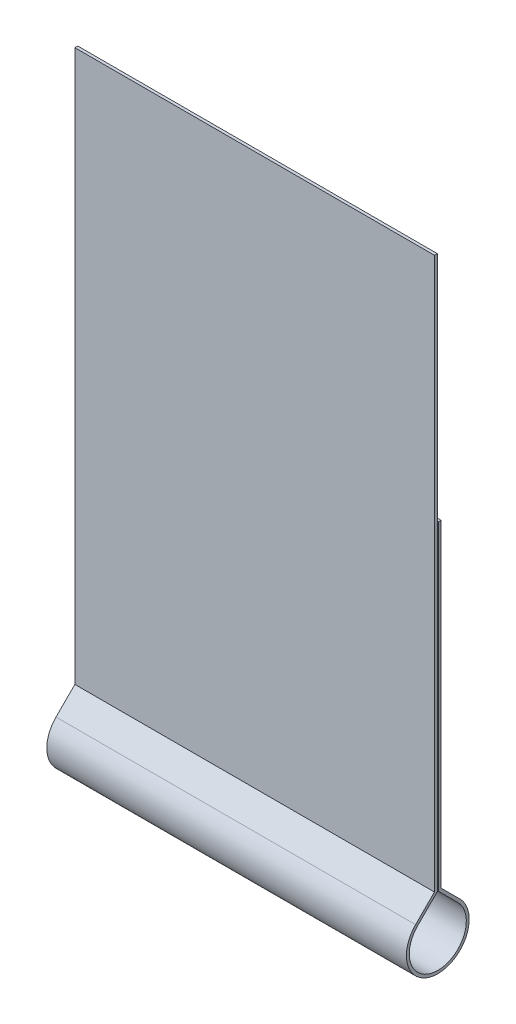
ISO-10303-21;
HEADER;
FILE_DESCRIPTION(('STEP AP214'),'2;1');
FILE_NAME('part.step','',(''),(''),'','','');
FILE_SCHEMA(('AUTOMOTIVE_DESIGN { 1 0 10303 214 1 1 1 1 }'));
ENDSEC;
DATA;
#1=APPLICATION_CONTEXT('core data for automotive mechanical design processes');
#2=APPLICATION_PROTOCOL_DEFINITION('international standard','automotive_design',2000,#1);
#3=PRODUCT_CONTEXT('',#1,'mechanical');
#4=PRODUCT('Part','Part','',(#3));
#5=PRODUCT_RELATED_PRODUCT_CATEGORY('part','',(#4));
#6=PRODUCT_DEFINITION_FORMATION('','',#4);
#7=PRODUCT_DEFINITION_CONTEXT('part definition',#1,'design');
#8=PRODUCT_DEFINITION('design','',#6,#7);
#9=PRODUCT_DEFINITION_SHAPE('','',#8);
#10=(LENGTH_UNIT() NAMED_UNIT(*) SI_UNIT(.MILLI.,.METRE.));
#11=(NAMED_UNIT(*) PLANE_ANGLE_UNIT() SI_UNIT($,.RADIAN.));
#12=(NAMED_UNIT(*) SI_UNIT($,.STERADIAN.) SOLID_ANGLE_UNIT());
#13=UNCERTAINTY_MEASURE_WITH_UNIT(LENGTH_MEASURE(1.E-05),#10,'distance_accuracy_value','');
#14=(GEOMETRIC_REPRESENTATION_CONTEXT(3) GLOBAL_UNCERTAINTY_ASSIGNED_CONTEXT((#13)) GLOBAL_UNIT_ASSIGNED_CONTEXT((#10,
#11,#12)) REPRESENTATION_CONTEXT('',''));
#15=CARTESIAN_POINT('',(0.,0.,0.));
#16=DIRECTION('',(0.,0.,1.));
#17=DIRECTION('',(1.,0.,0.));
#18=AXIS2_PLACEMENT_3D('',#15,#16,#17);
#19=CARTESIAN_POINT('',(9.525,2.14346403026728,0.0254000000000012));
#20=DIRECTION('',(0.,0.,1.));
#21=DIRECTION('',(1.,0.,0.));
#22=AXIS2_PLACEMENT_3D('',#19,#20,#21);
#23=PLANE('',#22);
#24=DIRECTION('',(0.,1.,0.));
#25=VECTOR('',#24,1.);
#26=CARTESIAN_POINT('',(-9.525,2.14346403026728,0.0254000000000012));
#27=LINE('',#26,#25);
#28=CARTESIAN_POINT('',(-9.525,2.11190095681445,0.0254000000000012));
#29=VERTEX_POINT('',#28);
#30=CARTESIAN_POINT('',(-9.525,31.39,0.0254000000000012));
#31=VERTEX_POINT('',#30);
#32=EDGE_CURVE('E163',#29,#31,#27,.T.);
#33=ORIENTED_EDGE('',*,*,#32,.T.);
#34=DIRECTION('',(-1.,0.,0.));
#35=VECTOR('',#34,1.);
#36=CARTESIAN_POINT('',(9.525,31.39,0.0254000000000012));
#37=LINE('',#36,#35);
#38=CARTESIAN_POINT('',(9.525,31.39,0.0254000000000012));
#39=VERTEX_POINT('',#38);
#40=EDGE_CURVE('E13',#39,#31,#37,.T.);
#41=ORIENTED_EDGE('',*,*,#40,.F.);
#42=DIRECTION('',(0.,1.,0.));
#43=VECTOR('',#42,1.);
#44=CARTESIAN_POINT('',(9.525,2.14346403026728,0.0254000000000012));
#45=LINE('',#44,#43);
#46=CARTESIAN_POINT('',(9.525,2.11190095681445,0.0254000000000012));
#47=VERTEX_POINT('',#46);
#48=EDGE_CURVE('E111',#47,#39,#45,.T.);
#49=ORIENTED_EDGE('',*,*,#48,.F.);
#50=DIRECTION('',(-1.,0.,0.));
#51=VECTOR('',#50,1.);
#52=CARTESIAN_POINT('',(9.525,2.11190095681445,0.0254000000000012));
#53=LINE('',#52,#51);
#54=EDGE_CURVE('E159',#47,#29,#53,.T.);
#55=ORIENTED_EDGE('',*,*,#54,.T.);
#56=EDGE_LOOP('',(#33,#41,#49,#55));
#57=FACE_BOUND('',#56,.T.);
#58=ADVANCED_FACE('F43',(#57),#23,.F.);
#59=CARTESIAN_POINT('',(9.525,31.39,0.177800000000001));
#60=DIRECTION('',(0.,1.,0.));
#61=DIRECTION('',(0.,0.,1.));
#62=AXIS2_PLACEMENT_3D('',#59,#60,#61);
#63=PLANE('',#62);
#64=DIRECTION('',(0.,0.,-1.));
#65=VECTOR('',#64,1.);
#66=CARTESIAN_POINT('',(-9.525,31.39,0.177800000000001));
#67=LINE('',#66,#65);
#68=CARTESIAN_POINT('',(-9.525,31.39,0.177800000000001));
#69=VERTEX_POINT('',#68);
#70=EDGE_CURVE('E166',#69,#31,#67,.T.);
#71=ORIENTED_EDGE('',*,*,#70,.F.);
#72=DIRECTION('',(-1.,0.,0.));
#73=VECTOR('',#72,1.);
#74=CARTESIAN_POINT('',(9.525,31.39,0.177800000000001));
#75=LINE('',#74,#73);
#76=CARTESIAN_POINT('',(9.525,31.39,0.177800000000001));
#77=VERTEX_POINT('',#76);
#78=EDGE_CURVE('E51',#77,#69,#75,.T.);
#79=ORIENTED_EDGE('',*,*,#78,.F.);
#80=DIRECTION('',(0.,0.,-1.));
#81=VECTOR('',#80,1.);
#82=CARTESIAN_POINT('',(9.525,31.39,0.177800000000001));
#83=LINE('',#82,#81);
#84=EDGE_CURVE('E228',#77,#39,#83,.T.);
#85=ORIENTED_EDGE('',*,*,#84,.T.);
#86=ORIENTED_EDGE('',*,*,#40,.T.);
#87=EDGE_LOOP('',(#71,#79,#85,#86));
#88=FACE_BOUND('',#87,.T.);
#89=ADVANCED_FACE('F215',(#88),#63,.T.);
#90=CARTESIAN_POINT('',(9.525,2.14346403026728,0.177800000000001));
#91=DIRECTION('',(0.,0.,1.));
#92=DIRECTION('',(1.,0.,0.));
#93=AXIS2_PLACEMENT_3D('',#90,#91,#92);
#94=PLANE('',#93);
#95=DIRECTION('',(0.,1.,0.));
#96=VECTOR('',#95,1.);
#97=CARTESIAN_POINT('',(-9.525,2.14346403026728,0.177800000000001));
#98=LINE('',#97,#96);
#99=CARTESIAN_POINT('',(-9.525,2.17502710372011,0.177800000000001));
#100=VERTEX_POINT('',#99);
#101=EDGE_CURVE('E169',#100,#69,#98,.T.);
#102=ORIENTED_EDGE('',*,*,#101,.F.);
#103=DIRECTION('',(-1.,0.,0.));
#104=VECTOR('',#103,1.);
#105=CARTESIAN_POINT('',(9.525,2.17502710372011,0.177800000000001));
#106=LINE('',#105,#104);
#107=CARTESIAN_POINT('',(9.525,2.17502710372011,0.177800000000001));
#108=VERTEX_POINT('',#107);
#109=EDGE_CURVE('E205',#108,#100,#106,.T.);
#110=ORIENTED_EDGE('',*,*,#109,.F.);
#111=DIRECTION('',(0.,1.,0.));
#112=VECTOR('',#111,1.);
#113=CARTESIAN_POINT('',(9.525,2.14346403026728,0.177800000000001));
#114=LINE('',#113,#112);
#115=EDGE_CURVE('E212',#108,#77,#114,.T.);
#116=ORIENTED_EDGE('',*,*,#115,.T.);
#117=ORIENTED_EDGE('',*,*,#78,.T.);
#118=EDGE_LOOP('',(#102,#110,#116,#117));
#119=FACE_BOUND('',#118,.T.);
#120=ADVANCED_FACE('F210',(#119),#94,.T.);
#121=CARTESIAN_POINT('',(9.525,1.17641355186006,1.17641355186006));
#122=DIRECTION('',(0.,0.707106781186549,0.707106781186546));
#123=DIRECTION('',(0.,-0.707106781186546,0.707106781186549));
#124=AXIS2_PLACEMENT_3D('',#121,#122,#123);
#125=PLANE('',#124);
#126=DIRECTION('',(0.,0.707106781186546,-0.707106781186549));
#127=VECTOR('',#126,1.);
#128=CARTESIAN_POINT('',(-9.525,1.17641355186006,1.17641355186006));
#129=LINE('',#128,#127);
#130=CARTESIAN_POINT('',(-9.525,1.17641355186006,1.17641355186006));
#131=VERTEX_POINT('',#130);
#132=EDGE_CURVE('E172',#131,#100,#129,.T.);
#133=ORIENTED_EDGE('',*,*,#132,.F.);
#134=DIRECTION('',(-1.,0.,0.));
#135=VECTOR('',#134,1.);
#136=CARTESIAN_POINT('',(9.525,1.17641355186006,1.17641355186006));
#137=LINE('',#136,#135);
#138=CARTESIAN_POINT('',(9.525,1.17641355186006,1.17641355186006));
#139=VERTEX_POINT('',#138);
#140=EDGE_CURVE('E203',#139,#131,#137,.T.);
#141=ORIENTED_EDGE('',*,*,#140,.F.);
#142=DIRECTION('',(0.,0.707106781186546,-0.707106781186549));
#143=VECTOR('',#142,1.);
#144=CARTESIAN_POINT('',(9.525,1.17641355186006,1.17641355186006));
#145=LINE('',#144,#143);
#146=EDGE_CURVE('E225',#139,#108,#145,.T.);
#147=ORIENTED_EDGE('',*,*,#146,.T.);
#148=ORIENTED_EDGE('',*,*,#109,.T.);
#149=EDGE_LOOP('',(#133,#141,#147,#148));
#150=FACE_BOUND('',#149,.T.);
#151=ADVANCED_FACE('F222',(#150),#125,.T.);
#152=CARTESIAN_POINT('',(9.525,0.,0.));
#153=DIRECTION('',(-1.,0.,0.));
#154=DIRECTION('',(0.,0.,1.));
#155=AXIS2_PLACEMENT_3D('',#152,#153,#154);
#156=CYLINDRICAL_SURFACE('',#155,1.6637);
#157=CARTESIAN_POINT('',(-9.525,0.,0.));
#158=DIRECTION('',(1.,0.,0.));
#159=DIRECTION('',(0.,0.,-1.));
#160=AXIS2_PLACEMENT_3D('',#157,#158,#159);
#161=CIRCLE('',#160,1.6637);
#162=CARTESIAN_POINT('',(-9.525,1.17641355186006,-1.17641355186006));
#163=VERTEX_POINT('',#162);
#164=EDGE_CURVE('E175',#163,#131,#161,.F.);
#165=ORIENTED_EDGE('',*,*,#164,.F.);
#166=DIRECTION('',(-1.,0.,0.));
#167=VECTOR('',#166,1.);
#168=CARTESIAN_POINT('',(9.525,1.17641355186006,-1.17641355186006));
#169=LINE('',#168,#167);
#170=CARTESIAN_POINT('',(9.525,1.17641355186006,-1.17641355186006));
#171=VERTEX_POINT('',#170);
#172=EDGE_CURVE('E201',#171,#163,#169,.T.);
#173=ORIENTED_EDGE('',*,*,#172,.F.);
#174=CARTESIAN_POINT('',(9.525,0.,0.));
#175=DIRECTION('',(1.,0.,0.));
#176=DIRECTION('',(0.,0.,-1.));
#177=AXIS2_PLACEMENT_3D('',#174,#175,#176);
#178=CIRCLE('',#177,1.6637);
#179=EDGE_CURVE('E230',#171,#139,#178,.F.);
#180=ORIENTED_EDGE('',*,*,#179,.T.);
#181=ORIENTED_EDGE('',*,*,#140,.T.);
#182=EDGE_LOOP('',(#165,#173,#180,#181));
#183=FACE_BOUND('',#182,.T.);
#184=ADVANCED_FACE('F330',(#183),#156,.T.);
#185=CARTESIAN_POINT('',(9.525,1.17641355186006,-1.17641355186006));
#186=DIRECTION('',(0.,0.707106781186549,-0.707106781186546));
#187=DIRECTION('',(0.,0.707106781186546,0.707106781186549));
#188=AXIS2_PLACEMENT_3D('',#185,#186,#187);
#189=PLANE('',#188);
#190=DIRECTION('',(0.,-0.707106781186546,-0.707106781186549));
#191=VECTOR('',#190,1.);
#192=CARTESIAN_POINT('',(-9.525,1.17641355186006,-1.17641355186006));
#193=LINE('',#192,#191);
#194=CARTESIAN_POINT('',(-9.525,2.17502710372011,-0.1778));
#195=VERTEX_POINT('',#194);
#196=EDGE_CURVE('E178',#195,#163,#193,.T.);
#197=ORIENTED_EDGE('',*,*,#196,.F.);
#198=DIRECTION('',(-1.,0.,0.));
#199=VECTOR('',#198,1.);
#200=CARTESIAN_POINT('',(9.525,2.17502710372011,-0.1778));
#201=LINE('',#200,#199);
#202=CARTESIAN_POINT('',(9.525,2.17502710372011,-0.1778));
#203=VERTEX_POINT('',#202);
#204=EDGE_CURVE('E199',#203,#195,#201,.T.);
#205=ORIENTED_EDGE('',*,*,#204,.F.);
#206=DIRECTION('',(0.,-0.707106781186546,-0.707106781186549));
#207=VECTOR('',#206,1.);
#208=CARTESIAN_POINT('',(9.525,1.17641355186006,-1.17641355186006));
#209=LINE('',#208,#207);
#210=EDGE_CURVE('E236',#203,#171,#209,.T.);
#211=ORIENTED_EDGE('',*,*,#210,.T.);
#212=ORIENTED_EDGE('',*,*,#172,.T.);
#213=EDGE_LOOP('',(#197,#205,#211,#212));
#214=FACE_BOUND('',#213,.T.);
#215=ADVANCED_FACE('F321',(#214),#189,.T.);
#216=CARTESIAN_POINT('',(9.525,2.14346403026728,-0.1778));
#217=DIRECTION('',(0.,0.,-1.));
#218=DIRECTION('',(0.,1.,0.));
#219=AXIS2_PLACEMENT_3D('',#216,#217,#218);
#220=PLANE('',#219);
#221=DIRECTION('',(0.,-1.,0.));
#222=VECTOR('',#221,1.);
#223=CARTESIAN_POINT('',(-9.525,2.14346403026728,-0.1778));
#224=LINE('',#223,#222);
#225=CARTESIAN_POINT('',(-9.525,19.05,-0.1778));
#226=VERTEX_POINT('',#225);
#227=EDGE_CURVE('E181',#226,#195,#224,.T.);
#228=ORIENTED_EDGE('',*,*,#227,.F.);
#229=DIRECTION('',(-1.,0.,0.));
#230=VECTOR('',#229,1.);
#231=CARTESIAN_POINT('',(9.525,19.05,-0.1778));
#232=LINE('',#231,#230);
#233=CARTESIAN_POINT('',(9.525,19.05,-0.1778));
#234=VERTEX_POINT('',#233);
#235=EDGE_CURVE('E197',#234,#226,#232,.T.);
#236=ORIENTED_EDGE('',*,*,#235,.F.);
#237=DIRECTION('',(0.,-1.,0.));
#238=VECTOR('',#237,1.);
#239=CARTESIAN_POINT('',(9.525,2.14346403026728,-0.1778));
#240=LINE('',#239,#238);
#241=EDGE_CURVE('E239',#234,#203,#240,.T.);
#242=ORIENTED_EDGE('',*,*,#241,.T.);
#243=ORIENTED_EDGE('',*,*,#204,.T.);
#244=EDGE_LOOP('',(#228,#236,#242,#243));
#245=FACE_BOUND('',#244,.T.);
#246=ADVANCED_FACE('F251',(#245),#220,.T.);
#247=CARTESIAN_POINT('',(9.525,19.05,-0.0254));
#248=DIRECTION('',(0.,1.,0.));
#249=DIRECTION('',(0.,0.,1.));
#250=AXIS2_PLACEMENT_3D('',#247,#248,#249);
#251=PLANE('',#250);
#252=DIRECTION('',(0.,0.,-1.));
#253=VECTOR('',#252,1.);
#254=CARTESIAN_POINT('',(-9.525,19.05,-0.0254));
#255=LINE('',#254,#253);
#256=CARTESIAN_POINT('',(-9.525,19.05,-0.0254));
#257=VERTEX_POINT('',#256);
#258=EDGE_CURVE('E184',#257,#226,#255,.T.);
#259=ORIENTED_EDGE('',*,*,#258,.F.);
#260=DIRECTION('',(-1.,0.,0.));
#261=VECTOR('',#260,1.);
#262=CARTESIAN_POINT('',(9.525,19.05,-0.0254));
#263=LINE('',#262,#261);
#264=CARTESIAN_POINT('',(9.525,19.05,-0.0254));
#265=VERTEX_POINT('',#264);
#266=EDGE_CURVE('E195',#265,#257,#263,.T.);
#267=ORIENTED_EDGE('',*,*,#266,.F.);
#268=DIRECTION('',(0.,0.,-1.));
#269=VECTOR('',#268,1.);
#270=CARTESIAN_POINT('',(9.525,19.05,-0.0254));
#271=LINE('',#270,#269);
#272=EDGE_CURVE('E242',#265,#234,#271,.T.);
#273=ORIENTED_EDGE('',*,*,#272,.T.);
#274=ORIENTED_EDGE('',*,*,#235,.T.);
#275=EDGE_LOOP('',(#259,#267,#273,#274));
#276=FACE_BOUND('',#275,.T.);
#277=ADVANCED_FACE('F246',(#276),#251,.T.);
#278=CARTESIAN_POINT('',(9.525,2.14346403026728,-0.0254000000000001));
#279=DIRECTION('',(0.,0.,-1.));
#280=DIRECTION('',(0.,1.,0.));
#281=AXIS2_PLACEMENT_3D('',#278,#279,#280);
#282=PLANE('',#281);
#283=DIRECTION('',(0.,-1.,0.));
#284=VECTOR('',#283,1.);
#285=CARTESIAN_POINT('',(-9.525,2.14346403026728,-0.0254000000000001));
#286=LINE('',#285,#284);
#287=CARTESIAN_POINT('',(-9.525,2.11190095681445,-0.0254000000000001));
#288=VERTEX_POINT('',#287);
#289=EDGE_CURVE('E187',#257,#288,#286,.T.);
#290=ORIENTED_EDGE('',*,*,#289,.T.);
#291=DIRECTION('',(-1.,0.,0.));
#292=VECTOR('',#291,1.);
#293=CARTESIAN_POINT('',(9.525,2.11190095681445,-0.0254000000000001));
#294=LINE('',#293,#292);
#295=CARTESIAN_POINT('',(9.525,2.11190095681445,-0.0254000000000001));
#296=VERTEX_POINT('',#295);
#297=EDGE_CURVE('E154',#296,#288,#294,.T.);
#298=ORIENTED_EDGE('',*,*,#297,.F.);
#299=DIRECTION('',(0.,-1.,0.));
#300=VECTOR('',#299,1.);
#301=CARTESIAN_POINT('',(9.525,2.14346403026728,-0.0254000000000001));
#302=LINE('',#301,#300);
#303=EDGE_CURVE('E145',#265,#296,#302,.T.);
#304=ORIENTED_EDGE('',*,*,#303,.F.);
#305=ORIENTED_EDGE('',*,*,#266,.T.);
#306=EDGE_LOOP('',(#290,#298,#304,#305));
#307=FACE_BOUND('',#306,.T.);
#308=ADVANCED_FACE('F255',(#307),#282,.F.);
#309=CARTESIAN_POINT('',(9.525,1.06865047840723,-1.06865047840723));
#310=DIRECTION('',(0.,0.707106781186549,-0.707106781186546));
#311=DIRECTION('',(0.,0.707106781186546,0.707106781186549));
#312=AXIS2_PLACEMENT_3D('',#309,#310,#311);
#313=PLANE('',#312);
#314=DIRECTION('',(0.,-0.707106781186546,-0.707106781186549));
#315=VECTOR('',#314,1.);
#316=CARTESIAN_POINT('',(-9.525,1.06865047840723,-1.06865047840723));
#317=LINE('',#316,#315);
#318=CARTESIAN_POINT('',(-9.525,1.06865047840723,-1.06865047840723));
#319=VERTEX_POINT('',#318);
#320=EDGE_CURVE('E153',#288,#319,#317,.T.);
#321=ORIENTED_EDGE('',*,*,#320,.T.);
#322=DIRECTION('',(-1.,0.,0.));
#323=VECTOR('',#322,1.);
#324=CARTESIAN_POINT('',(9.525,1.06865047840723,-1.06865047840723));
#325=LINE('',#324,#323);
#326=CARTESIAN_POINT('',(9.525,1.06865047840723,-1.06865047840723));
#327=VERTEX_POINT('',#326);
#328=EDGE_CURVE('E150',#327,#319,#325,.T.);
#329=ORIENTED_EDGE('',*,*,#328,.F.);
#330=DIRECTION('',(0.,-0.707106781186546,-0.707106781186549));
#331=VECTOR('',#330,1.);
#332=CARTESIAN_POINT('',(9.525,1.06865047840723,-1.06865047840723));
#333=LINE('',#332,#331);
#334=EDGE_CURVE('E138',#296,#327,#333,.T.);
#335=ORIENTED_EDGE('',*,*,#334,.F.);
#336=ORIENTED_EDGE('',*,*,#297,.T.);
#337=EDGE_LOOP('',(#321,#329,#335,#336));
#338=FACE_BOUND('',#337,.T.);
#339=ADVANCED_FACE('F151',(#338),#313,.F.);
#340=CARTESIAN_POINT('',(9.525,0.,0.));
#341=DIRECTION('',(-1.,0.,0.));
#342=DIRECTION('',(0.,0.,1.));
#343=AXIS2_PLACEMENT_3D('',#340,#341,#342);
#344=CYLINDRICAL_SURFACE('',#343,1.5113);
#345=CARTESIAN_POINT('',(-9.525,0.,0.));
#346=DIRECTION('',(1.,0.,0.));
#347=DIRECTION('',(0.,0.,-1.));
#348=AXIS2_PLACEMENT_3D('',#345,#346,#347);
#349=CIRCLE('',#348,1.5113);
#350=CARTESIAN_POINT('',(-9.525,1.06865047840723,1.06865047840723));
#351=VERTEX_POINT('',#350);
#352=EDGE_CURVE('E99',#319,#351,#349,.F.);
#353=ORIENTED_EDGE('',*,*,#352,.T.);
#354=DIRECTION('',(-1.,0.,0.));
#355=VECTOR('',#354,1.);
#356=CARTESIAN_POINT('',(9.525,1.06865047840723,1.06865047840723));
#357=LINE('',#356,#355);
#358=CARTESIAN_POINT('',(9.525,1.06865047840723,1.06865047840723));
#359=VERTEX_POINT('',#358);
#360=EDGE_CURVE('E155',#359,#351,#357,.T.);
#361=ORIENTED_EDGE('',*,*,#360,.F.);
#362=CARTESIAN_POINT('',(9.525,0.,0.));
#363=DIRECTION('',(1.,0.,0.));
#364=DIRECTION('',(0.,0.,-1.));
#365=AXIS2_PLACEMENT_3D('',#362,#363,#364);
#366=CIRCLE('',#365,1.5113);
#367=EDGE_CURVE('E142',#327,#359,#366,.F.);
#368=ORIENTED_EDGE('',*,*,#367,.F.);
#369=ORIENTED_EDGE('',*,*,#328,.T.);
#370=EDGE_LOOP('',(#353,#361,#368,#369));
#371=FACE_BOUND('',#370,.T.);
#372=ADVANCED_FACE('F157',(#371),#344,.F.);
#373=CARTESIAN_POINT('',(9.525,1.06865047840723,1.06865047840723));
#374=DIRECTION('',(0.,0.707106781186549,0.707106781186546));
#375=DIRECTION('',(0.,-0.707106781186546,0.707106781186549));
#376=AXIS2_PLACEMENT_3D('',#373,#374,#375);
#377=PLANE('',#376);
#378=DIRECTION('',(0.,0.707106781186546,-0.707106781186549));
#379=VECTOR('',#378,1.);
#380=CARTESIAN_POINT('',(-9.525,1.06865047840723,1.06865047840723));
#381=LINE('',#380,#379);
#382=EDGE_CURVE('E105',#351,#29,#381,.T.);
#383=ORIENTED_EDGE('',*,*,#382,.T.);
#384=ORIENTED_EDGE('',*,*,#54,.F.);
#385=DIRECTION('',(0.,0.707106781186546,-0.707106781186549));
#386=VECTOR('',#385,1.);
#387=CARTESIAN_POINT('',(9.525,1.06865047840723,1.06865047840723));
#388=LINE('',#387,#386);
#389=EDGE_CURVE('E59',#359,#47,#388,.T.);
#390=ORIENTED_EDGE('',*,*,#389,.F.);
#391=ORIENTED_EDGE('',*,*,#360,.T.);
#392=EDGE_LOOP('',(#383,#384,#390,#391));
#393=FACE_BOUND('',#392,.T.);
#394=ADVANCED_FACE('F269',(#393),#377,.F.);
#395=CARTESIAN_POINT('',(9.525,0.,0.));
#396=DIRECTION('',(1.,0.,0.));
#397=DIRECTION('',(0.,0.,-1.));
#398=AXIS2_PLACEMENT_3D('',#395,#396,#397);
#399=PLANE('',#398);
#400=ORIENTED_EDGE('',*,*,#48,.T.);
#401=ORIENTED_EDGE('',*,*,#84,.F.);
#402=ORIENTED_EDGE('',*,*,#115,.F.);
#403=ORIENTED_EDGE('',*,*,#146,.F.);
#404=ORIENTED_EDGE('',*,*,#179,.F.);
#405=ORIENTED_EDGE('',*,*,#210,.F.);
#406=ORIENTED_EDGE('',*,*,#241,.F.);
#407=ORIENTED_EDGE('',*,*,#272,.F.);
#408=ORIENTED_EDGE('',*,*,#303,.T.);
#409=ORIENTED_EDGE('',*,*,#334,.T.);
#410=ORIENTED_EDGE('',*,*,#367,.T.);
#411=ORIENTED_EDGE('',*,*,#389,.T.);
#412=EDGE_LOOP('',(#400,#401,#402,#403,#404,#405,#406,#407,#408,#409,#410,#411));
#413=FACE_BOUND('',#412,.T.);
#414=ADVANCED_FACE('F140',(#413),#399,.T.);
#415=CARTESIAN_POINT('',(-9.525,0.,0.));
#416=DIRECTION('',(1.,0.,0.));
#417=DIRECTION('',(0.,0.,-1.));
#418=AXIS2_PLACEMENT_3D('',#415,#416,#417);
#419=PLANE('',#418);
#420=ORIENTED_EDGE('',*,*,#32,.F.);
#421=ORIENTED_EDGE('',*,*,#382,.F.);
#422=ORIENTED_EDGE('',*,*,#352,.F.);
#423=ORIENTED_EDGE('',*,*,#320,.F.);
#424=ORIENTED_EDGE('',*,*,#289,.F.);
#425=ORIENTED_EDGE('',*,*,#258,.T.);
#426=ORIENTED_EDGE('',*,*,#227,.T.);
#427=ORIENTED_EDGE('',*,*,#196,.T.);
#428=ORIENTED_EDGE('',*,*,#164,.T.);
#429=ORIENTED_EDGE('',*,*,#132,.T.);
#430=ORIENTED_EDGE('',*,*,#101,.T.);
#431=ORIENTED_EDGE('',*,*,#70,.T.);
#432=EDGE_LOOP('',(#420,#421,#422,#423,#424,#425,#426,#427,#428,#429,#430,#431));
#433=FACE_BOUND('',#432,.T.);
#434=ADVANCED_FACE('F218',(#433),#419,.F.);
#435=CLOSED_SHELL('',(#58,#89,#120,#151,#184,#215,#246,#277,#308,#339,#372,#394,#414,#434));
#436=MANIFOLD_SOLID_BREP('B2',#435);
#437=ADVANCED_BREP_SHAPE_REPRESENTATION('',(#18,#436),#14);
#438=SHAPE_DEFINITION_REPRESENTATION(#9,#437);
ENDSEC;
END-ISO-10303-21;
